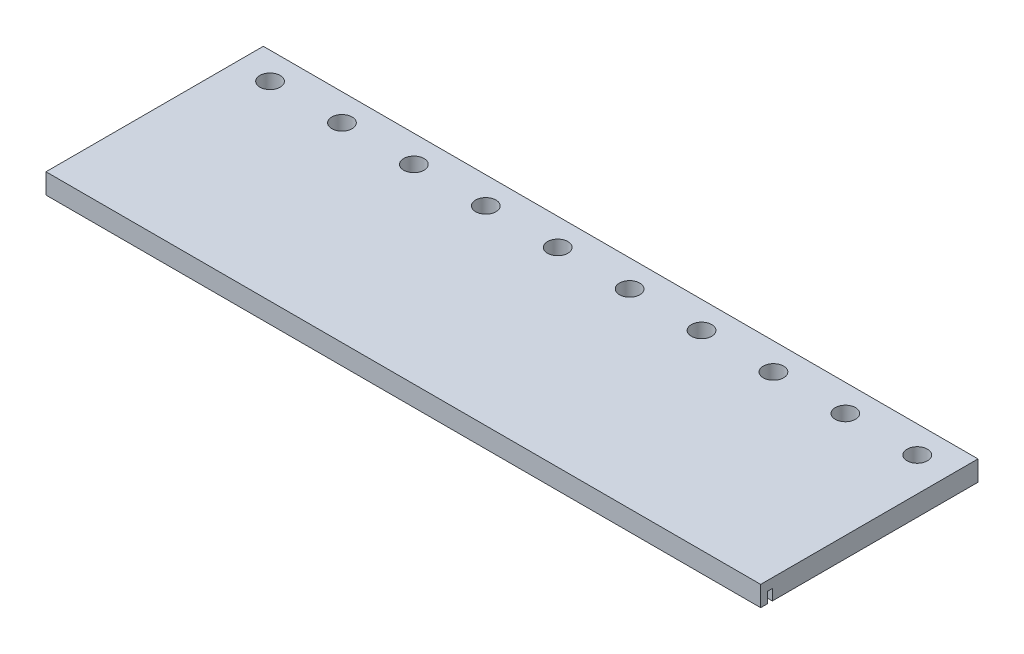
ISO-10303-21;
HEADER;
FILE_DESCRIPTION(('STEP AP214'),'2;1');
FILE_NAME('part.step','',(''),(''),'','','');
FILE_SCHEMA(('AUTOMOTIVE_DESIGN { 1 0 10303 214 1 1 1 1 }'));
ENDSEC;
DATA;
#1=APPLICATION_CONTEXT('core data for automotive mechanical design processes');
#2=APPLICATION_PROTOCOL_DEFINITION('international standard','automotive_design',2000,#1);
#3=PRODUCT_CONTEXT('',#1,'mechanical');
#4=PRODUCT('Part','Part','',(#3));
#5=PRODUCT_RELATED_PRODUCT_CATEGORY('part','',(#4));
#6=PRODUCT_DEFINITION_FORMATION('','',#4);
#7=PRODUCT_DEFINITION_CONTEXT('part definition',#1,'design');
#8=PRODUCT_DEFINITION('design','',#6,#7);
#9=PRODUCT_DEFINITION_SHAPE('','',#8);
#10=(LENGTH_UNIT() NAMED_UNIT(*) SI_UNIT(.MILLI.,.METRE.));
#11=(NAMED_UNIT(*) PLANE_ANGLE_UNIT() SI_UNIT($,.RADIAN.));
#12=(NAMED_UNIT(*) SI_UNIT($,.STERADIAN.) SOLID_ANGLE_UNIT());
#13=UNCERTAINTY_MEASURE_WITH_UNIT(LENGTH_MEASURE(1.E-05),#10,'distance_accuracy_value','');
#14=(GEOMETRIC_REPRESENTATION_CONTEXT(3) GLOBAL_UNCERTAINTY_ASSIGNED_CONTEXT((#13)) GLOBAL_UNIT_ASSIGNED_CONTEXT((#10,
#11,#12)) REPRESENTATION_CONTEXT('',''));
#15=CARTESIAN_POINT('',(0.,0.,0.));
#16=DIRECTION('',(0.,0.,1.));
#17=DIRECTION('',(1.,0.,0.));
#18=AXIS2_PLACEMENT_3D('',#15,#16,#17);
#19=CARTESIAN_POINT('',(0.,-9.525,0.));
#20=DIRECTION('',(0.,-1.,0.));
#21=DIRECTION('',(0.,0.,-1.));
#22=AXIS2_PLACEMENT_3D('',#19,#20,#21);
#23=PLANE('',#22);
#24=CARTESIAN_POINT('',(-323.05625,-9.525,-34.2920964653036));
#25=DIRECTION('',(0.,-1.,0.));
#26=DIRECTION('',(0.,0.,-1.));
#27=AXIS2_PLACEMENT_3D('',#24,#25,#26);
#28=CIRCLE('',#27,8.001);
#29=CARTESIAN_POINT('',(-323.05625,-9.525,-26.2910964653036));
#30=VERTEX_POINT('',#29);
#31=CARTESIAN_POINT('',(-323.05625,-9.525,-42.2930964653036));
#32=VERTEX_POINT('',#31);
#33=EDGE_CURVE('E47',#30,#32,#28,.T.);
#34=ORIENTED_EDGE('',*,*,#33,.F.);
#35=DIRECTION('',(-1.,0.,0.));
#36=VECTOR('',#35,1.);
#37=CARTESIAN_POINT('',(-323.05625,-9.525,-26.2910964653036));
#38=LINE('',#37,#36);
#39=CARTESIAN_POINT('',(323.05625,-9.525,-26.2910964653035));
#40=VERTEX_POINT('',#39);
#41=EDGE_CURVE('E141',#40,#30,#38,.T.);
#42=ORIENTED_EDGE('',*,*,#41,.F.);
#43=CARTESIAN_POINT('',(323.05625,-9.525,-34.2920964653035));
#44=DIRECTION('',(0.,-1.,0.));
#45=DIRECTION('',(0.,0.,-1.));
#46=AXIS2_PLACEMENT_3D('',#43,#44,#45);
#47=CIRCLE('',#46,8.001);
#48=CARTESIAN_POINT('',(323.05625,-9.525,-42.2930964653035));
#49=VERTEX_POINT('',#48);
#50=EDGE_CURVE('E144',#49,#40,#47,.T.);
#51=ORIENTED_EDGE('',*,*,#50,.F.);
#52=DIRECTION('',(1.,0.,0.));
#53=VECTOR('',#52,1.);
#54=CARTESIAN_POINT('',(-323.05625,-9.525,-42.2930964653036));
#55=LINE('',#54,#53);
#56=EDGE_CURVE('E150',#32,#49,#55,.T.);
#57=ORIENTED_EDGE('',*,*,#56,.F.);
#58=EDGE_LOOP('',(#34,#42,#51,#57));
#59=FACE_BOUND('',#58,.T.);
#60=DIRECTION('',(1.,0.,0.));
#61=VECTOR('',#60,1.);
#62=CARTESIAN_POINT('',(336.55,-9.525,91.3365458000001));
#63=LINE('',#62,#61);
#64=CARTESIAN_POINT('',(-336.55,-9.525,91.3365458));
#65=VERTEX_POINT('',#64);
#66=CARTESIAN_POINT('',(336.55,-9.525,91.3365458000001));
#67=VERTEX_POINT('',#66);
#68=EDGE_CURVE('E164',#65,#67,#63,.T.);
#69=ORIENTED_EDGE('',*,*,#68,.F.);
#70=DIRECTION('',(0.,0.,1.));
#71=VECTOR('',#70,1.);
#72=CARTESIAN_POINT('',(-336.55,-9.525,-102.3366));
#73=LINE('',#72,#71);
#74=CARTESIAN_POINT('',(-336.55,-9.525,-102.3366));
#75=VERTEX_POINT('',#74);
#76=EDGE_CURVE('E255',#75,#65,#73,.T.);
#77=ORIENTED_EDGE('',*,*,#76,.F.);
#78=DIRECTION('',(-1.,0.,0.));
#79=VECTOR('',#78,1.);
#80=CARTESIAN_POINT('',(336.55,-9.525,-102.3366));
#81=LINE('',#80,#79);
#82=CARTESIAN_POINT('',(336.55,-9.525,-102.3366));
#83=VERTEX_POINT('',#82);
#84=EDGE_CURVE('E248',#83,#75,#81,.T.);
#85=ORIENTED_EDGE('',*,*,#84,.F.);
#86=DIRECTION('',(0.,0.,-1.));
#87=VECTOR('',#86,1.);
#88=CARTESIAN_POINT('',(336.55,-9.525,-102.3366));
#89=LINE('',#88,#87);
#90=EDGE_CURVE('E260',#67,#83,#89,.T.);
#91=ORIENTED_EDGE('',*,*,#90,.F.);
#92=EDGE_LOOP('',(#69,#77,#85,#91));
#93=FACE_BOUND('',#92,.T.);
#94=CARTESIAN_POINT('',(-304.8,-9.525,-76.9303710175037));
#95=DIRECTION('',(0.,1.,0.));
#96=DIRECTION('',(0.,0.,1.));
#97=AXIS2_PLACEMENT_3D('',#94,#95,#96);
#98=CIRCLE('',#97,9.58458710352719);
#99=CARTESIAN_POINT('',(-304.8,-9.525,-67.3457839139765));
#100=VERTEX_POINT('',#99);
#101=EDGE_CURVE('E184',#100,#100,#98,.T.);
#102=ORIENTED_EDGE('',*,*,#101,.T.);
#103=EDGE_LOOP('',(#102));
#104=FACE_BOUND('',#103,.T.);
#105=CARTESIAN_POINT('',(-237.0709,-9.525,-76.9303710175037));
#106=DIRECTION('',(0.,1.,0.));
#107=DIRECTION('',(0.,0.,1.));
#108=AXIS2_PLACEMENT_3D('',#105,#106,#107);
#109=CIRCLE('',#108,9.58458710352719);
#110=CARTESIAN_POINT('',(-237.0709,-9.525,-67.3457839139765));
#111=VERTEX_POINT('',#110);
#112=EDGE_CURVE('E188',#111,#111,#109,.T.);
#113=ORIENTED_EDGE('',*,*,#112,.T.);
#114=EDGE_LOOP('',(#113));
#115=FACE_BOUND('',#114,.T.);
#116=CARTESIAN_POINT('',(-169.3418,-9.525,-76.9303710175037));
#117=DIRECTION('',(0.,1.,0.));
#118=DIRECTION('',(0.,0.,1.));
#119=AXIS2_PLACEMENT_3D('',#116,#117,#118);
#120=CIRCLE('',#119,9.58458710352719);
#121=CARTESIAN_POINT('',(-169.3418,-9.525,-67.3457839139765));
#122=VERTEX_POINT('',#121);
#123=EDGE_CURVE('E191',#122,#122,#120,.T.);
#124=ORIENTED_EDGE('',*,*,#123,.T.);
#125=EDGE_LOOP('',(#124));
#126=FACE_BOUND('',#125,.T.);
#127=CARTESIAN_POINT('',(-101.6127,-9.525,-76.9303710175037));
#128=DIRECTION('',(0.,1.,0.));
#129=DIRECTION('',(0.,0.,1.));
#130=AXIS2_PLACEMENT_3D('',#127,#128,#129);
#131=CIRCLE('',#130,9.58458710352719);
#132=CARTESIAN_POINT('',(-101.6127,-9.525,-67.3457839139765));
#133=VERTEX_POINT('',#132);
#134=EDGE_CURVE('E194',#133,#133,#131,.T.);
#135=ORIENTED_EDGE('',*,*,#134,.T.);
#136=EDGE_LOOP('',(#135));
#137=FACE_BOUND('',#136,.T.);
#138=CARTESIAN_POINT('',(-33.8836000000001,-9.525,-76.9303710175037));
#139=DIRECTION('',(0.,1.,0.));
#140=DIRECTION('',(0.,0.,1.));
#141=AXIS2_PLACEMENT_3D('',#138,#139,#140);
#142=CIRCLE('',#141,9.58458710352719);
#143=CARTESIAN_POINT('',(-33.8836000000001,-9.525,-67.3457839139765));
#144=VERTEX_POINT('',#143);
#145=EDGE_CURVE('E197',#144,#144,#142,.T.);
#146=ORIENTED_EDGE('',*,*,#145,.T.);
#147=EDGE_LOOP('',(#146));
#148=FACE_BOUND('',#147,.T.);
#149=CARTESIAN_POINT('',(33.8454999999999,-9.525,-76.9303710175037));
#150=DIRECTION('',(0.,1.,0.));
#151=DIRECTION('',(0.,0.,1.));
#152=AXIS2_PLACEMENT_3D('',#149,#150,#151);
#153=CIRCLE('',#152,9.58458710352719);
#154=CARTESIAN_POINT('',(33.8454999999999,-9.525,-67.3457839139765));
#155=VERTEX_POINT('',#154);
#156=EDGE_CURVE('E200',#155,#155,#153,.T.);
#157=ORIENTED_EDGE('',*,*,#156,.T.);
#158=EDGE_LOOP('',(#157));
#159=FACE_BOUND('',#158,.T.);
#160=CARTESIAN_POINT('',(101.5746,-9.525,-76.9303710175037));
#161=DIRECTION('',(0.,1.,0.));
#162=DIRECTION('',(0.,0.,1.));
#163=AXIS2_PLACEMENT_3D('',#160,#161,#162);
#164=CIRCLE('',#163,9.58458710352719);
#165=CARTESIAN_POINT('',(101.5746,-9.525,-67.3457839139765));
#166=VERTEX_POINT('',#165);
#167=EDGE_CURVE('E203',#166,#166,#164,.T.);
#168=ORIENTED_EDGE('',*,*,#167,.T.);
#169=EDGE_LOOP('',(#168));
#170=FACE_BOUND('',#169,.T.);
#171=CARTESIAN_POINT('',(169.3037,-9.525,-76.9303710175037));
#172=DIRECTION('',(0.,1.,0.));
#173=DIRECTION('',(0.,0.,1.));
#174=AXIS2_PLACEMENT_3D('',#171,#172,#173);
#175=CIRCLE('',#174,9.58458710352719);
#176=CARTESIAN_POINT('',(169.3037,-9.525,-67.3457839139765));
#177=VERTEX_POINT('',#176);
#178=EDGE_CURVE('E206',#177,#177,#175,.T.);
#179=ORIENTED_EDGE('',*,*,#178,.T.);
#180=EDGE_LOOP('',(#179));
#181=FACE_BOUND('',#180,.T.);
#182=CARTESIAN_POINT('',(237.0328,-9.525,-76.9303710175037));
#183=DIRECTION('',(0.,1.,0.));
#184=DIRECTION('',(0.,0.,1.));
#185=AXIS2_PLACEMENT_3D('',#182,#183,#184);
#186=CIRCLE('',#185,9.58458710352719);
#187=CARTESIAN_POINT('',(237.0328,-9.525,-67.3457839139765));
#188=VERTEX_POINT('',#187);
#189=EDGE_CURVE('E209',#188,#188,#186,.T.);
#190=ORIENTED_EDGE('',*,*,#189,.T.);
#191=EDGE_LOOP('',(#190));
#192=FACE_BOUND('',#191,.T.);
#193=CARTESIAN_POINT('',(304.7619,-9.525,-76.9303710175037));
#194=DIRECTION('',(0.,1.,0.));
#195=DIRECTION('',(0.,0.,1.));
#196=AXIS2_PLACEMENT_3D('',#193,#194,#195);
#197=CIRCLE('',#196,9.58458710352719);
#198=CARTESIAN_POINT('',(304.7619,-9.525,-67.3457839139765));
#199=VERTEX_POINT('',#198);
#200=EDGE_CURVE('E177',#199,#199,#197,.T.);
#201=ORIENTED_EDGE('',*,*,#200,.T.);
#202=EDGE_LOOP('',(#201));
#203=FACE_BOUND('',#202,.T.);
#204=ADVANCED_FACE('F32',(#59,#93,#104,#115,#126,#137,#148,#159,#170,#181,#192,#203),#23,.T.);
#205=CARTESIAN_POINT('',(-336.55,9.525,-102.3366));
#206=DIRECTION('',(1.,0.,0.));
#207=DIRECTION('',(0.,0.,-1.));
#208=AXIS2_PLACEMENT_3D('',#205,#206,#207);
#209=PLANE('',#208);
#210=ORIENTED_EDGE('',*,*,#76,.T.);
#211=DIRECTION('',(0.,-1.,0.));
#212=VECTOR('',#211,1.);
#213=CARTESIAN_POINT('',(-336.55,0.635,91.3365458));
#214=LINE('',#213,#212);
#215=CARTESIAN_POINT('',(-336.55,0.635,91.3365458));
#216=VERTEX_POINT('',#215);
#217=EDGE_CURVE('E178',#216,#65,#214,.T.);
#218=ORIENTED_EDGE('',*,*,#217,.F.);
#219=DIRECTION('',(0.,0.,-1.));
#220=VECTOR('',#219,1.);
#221=CARTESIAN_POINT('',(-336.55,0.635,96.0355458));
#222=LINE('',#221,#220);
#223=CARTESIAN_POINT('',(-336.55,0.635,96.0355458));
#224=VERTEX_POINT('',#223);
#225=EDGE_CURVE('E167',#224,#216,#222,.T.);
#226=ORIENTED_EDGE('',*,*,#225,.F.);
#227=DIRECTION('',(0.,-1.,0.));
#228=VECTOR('',#227,1.);
#229=CARTESIAN_POINT('',(-336.55,0.635,96.0355458));
#230=LINE('',#229,#228);
#231=CARTESIAN_POINT('',(-336.55,-9.525,96.0355458));
#232=VERTEX_POINT('',#231);
#233=EDGE_CURVE('E180',#224,#232,#230,.T.);
#234=ORIENTED_EDGE('',*,*,#233,.T.);
#235=CARTESIAN_POINT('',(-336.55,-9.525,102.3366));
#236=VERTEX_POINT('',#235);
#237=EDGE_CURVE('E243',#232,#236,#73,.T.);
#238=ORIENTED_EDGE('',*,*,#237,.T.);
#239=DIRECTION('',(0.,-1.,0.));
#240=VECTOR('',#239,1.);
#241=CARTESIAN_POINT('',(-336.55,9.525,102.3366));
#242=LINE('',#241,#240);
#243=CARTESIAN_POINT('',(-336.55,9.525,102.3366));
#244=VERTEX_POINT('',#243);
#245=EDGE_CURVE('E11',#244,#236,#242,.T.);
#246=ORIENTED_EDGE('',*,*,#245,.F.);
#247=DIRECTION('',(0.,0.,1.));
#248=VECTOR('',#247,1.);
#249=CARTESIAN_POINT('',(-336.55,9.525,-102.3366));
#250=LINE('',#249,#248);
#251=CARTESIAN_POINT('',(-336.55,9.525,-102.3366));
#252=VERTEX_POINT('',#251);
#253=EDGE_CURVE('E244',#252,#244,#250,.T.);
#254=ORIENTED_EDGE('',*,*,#253,.F.);
#255=DIRECTION('',(0.,-1.,0.));
#256=VECTOR('',#255,1.);
#257=CARTESIAN_POINT('',(-336.55,9.525,-102.3366));
#258=LINE('',#257,#256);
#259=EDGE_CURVE('E254',#252,#75,#258,.T.);
#260=ORIENTED_EDGE('',*,*,#259,.T.);
#261=EDGE_LOOP('',(#210,#218,#226,#234,#238,#246,#254,#260));
#262=FACE_BOUND('',#261,.T.);
#263=ADVANCED_FACE('F34',(#262),#209,.F.);
#264=CARTESIAN_POINT('',(336.55,9.525,102.3366));
#265=DIRECTION('',(0.,0.,-1.));
#266=DIRECTION('',(-1.,0.,0.));
#267=AXIS2_PLACEMENT_3D('',#264,#265,#266);
#268=PLANE('',#267);
#269=DIRECTION('',(1.,0.,0.));
#270=VECTOR('',#269,1.);
#271=CARTESIAN_POINT('',(336.55,-9.525,102.3366));
#272=LINE('',#271,#270);
#273=CARTESIAN_POINT('',(336.55,-9.525,102.3366));
#274=VERTEX_POINT('',#273);
#275=EDGE_CURVE('E258',#236,#274,#272,.T.);
#276=ORIENTED_EDGE('',*,*,#275,.T.);
#277=DIRECTION('',(0.,-1.,0.));
#278=VECTOR('',#277,1.);
#279=CARTESIAN_POINT('',(336.55,9.525,102.3366));
#280=LINE('',#279,#278);
#281=CARTESIAN_POINT('',(336.55,9.525,102.3366));
#282=VERTEX_POINT('',#281);
#283=EDGE_CURVE('E40',#282,#274,#280,.T.);
#284=ORIENTED_EDGE('',*,*,#283,.F.);
#285=DIRECTION('',(1.,0.,0.));
#286=VECTOR('',#285,1.);
#287=CARTESIAN_POINT('',(336.55,9.525,102.3366));
#288=LINE('',#287,#286);
#289=EDGE_CURVE('E247',#244,#282,#288,.T.);
#290=ORIENTED_EDGE('',*,*,#289,.F.);
#291=ORIENTED_EDGE('',*,*,#245,.T.);
#292=EDGE_LOOP('',(#276,#284,#290,#291));
#293=FACE_BOUND('',#292,.T.);
#294=ADVANCED_FACE('F305',(#293),#268,.F.);
#295=CARTESIAN_POINT('',(336.55,9.525,-102.3366));
#296=DIRECTION('',(-1.,0.,0.));
#297=DIRECTION('',(0.,0.,1.));
#298=AXIS2_PLACEMENT_3D('',#295,#296,#297);
#299=PLANE('',#298);
#300=DIRECTION('',(0.,0.,1.));
#301=VECTOR('',#300,1.);
#302=CARTESIAN_POINT('',(336.55,0.635,96.0355458000001));
#303=LINE('',#302,#301);
#304=CARTESIAN_POINT('',(336.55,0.635,91.3365458000001));
#305=VERTEX_POINT('',#304);
#306=CARTESIAN_POINT('',(336.55,0.635,96.0355458000001));
#307=VERTEX_POINT('',#306);
#308=EDGE_CURVE('E160',#305,#307,#303,.T.);
#309=ORIENTED_EDGE('',*,*,#308,.F.);
#310=DIRECTION('',(0.,-1.,0.));
#311=VECTOR('',#310,1.);
#312=CARTESIAN_POINT('',(336.55,0.635,91.3365458000001));
#313=LINE('',#312,#311);
#314=EDGE_CURVE('E174',#305,#67,#313,.T.);
#315=ORIENTED_EDGE('',*,*,#314,.T.);
#316=ORIENTED_EDGE('',*,*,#90,.T.);
#317=DIRECTION('',(0.,-1.,0.));
#318=VECTOR('',#317,1.);
#319=CARTESIAN_POINT('',(336.55,9.525,-102.3366));
#320=LINE('',#319,#318);
#321=CARTESIAN_POINT('',(336.55,9.525,-102.3366));
#322=VERTEX_POINT('',#321);
#323=EDGE_CURVE('E267',#322,#83,#320,.T.);
#324=ORIENTED_EDGE('',*,*,#323,.F.);
#325=DIRECTION('',(0.,0.,-1.));
#326=VECTOR('',#325,1.);
#327=CARTESIAN_POINT('',(336.55,9.525,-102.3366));
#328=LINE('',#327,#326);
#329=EDGE_CURVE('E250',#282,#322,#328,.T.);
#330=ORIENTED_EDGE('',*,*,#329,.F.);
#331=ORIENTED_EDGE('',*,*,#283,.T.);
#332=CARTESIAN_POINT('',(336.55,-9.525,96.0355458000001));
#333=VERTEX_POINT('',#332);
#334=EDGE_CURVE('E261',#274,#333,#89,.T.);
#335=ORIENTED_EDGE('',*,*,#334,.T.);
#336=DIRECTION('',(0.,-1.,0.));
#337=VECTOR('',#336,1.);
#338=CARTESIAN_POINT('',(336.55,0.635,96.0355458000001));
#339=LINE('',#338,#337);
#340=EDGE_CURVE('E55',#307,#333,#339,.T.);
#341=ORIENTED_EDGE('',*,*,#340,.F.);
#342=EDGE_LOOP('',(#309,#315,#316,#324,#330,#331,#335,#341));
#343=FACE_BOUND('',#342,.T.);
#344=ADVANCED_FACE('F275',(#343),#299,.F.);
#345=CARTESIAN_POINT('',(336.55,9.525,-102.3366));
#346=DIRECTION('',(0.,0.,1.));
#347=DIRECTION('',(1.,0.,0.));
#348=AXIS2_PLACEMENT_3D('',#345,#346,#347);
#349=PLANE('',#348);
#350=ORIENTED_EDGE('',*,*,#84,.T.);
#351=ORIENTED_EDGE('',*,*,#259,.F.);
#352=DIRECTION('',(-1.,0.,0.));
#353=VECTOR('',#352,1.);
#354=CARTESIAN_POINT('',(336.55,9.525,-102.3366));
#355=LINE('',#354,#353);
#356=EDGE_CURVE('E252',#322,#252,#355,.T.);
#357=ORIENTED_EDGE('',*,*,#356,.F.);
#358=ORIENTED_EDGE('',*,*,#323,.T.);
#359=EDGE_LOOP('',(#350,#351,#357,#358));
#360=FACE_BOUND('',#359,.T.);
#361=ADVANCED_FACE('F300',(#360),#349,.F.);
#362=CARTESIAN_POINT('',(0.,9.525,0.));
#363=DIRECTION('',(0.,-1.,0.));
#364=DIRECTION('',(0.,0.,-1.));
#365=AXIS2_PLACEMENT_3D('',#362,#363,#364);
#366=PLANE('',#365);
#367=CARTESIAN_POINT('',(-304.8,9.525,-76.9303710175037));
#368=DIRECTION('',(0.,-1.,0.));
#369=DIRECTION('',(0.,0.,-1.));
#370=AXIS2_PLACEMENT_3D('',#367,#368,#369);
#371=CIRCLE('',#370,9.58458710352719);
#372=CARTESIAN_POINT('',(-304.8,9.525,-86.5149581210309));
#373=VERTEX_POINT('',#372);
#374=EDGE_CURVE('E240',#373,#373,#371,.T.);
#375=ORIENTED_EDGE('',*,*,#374,.T.);
#376=EDGE_LOOP('',(#375));
#377=FACE_BOUND('',#376,.T.);
#378=CARTESIAN_POINT('',(-237.0709,9.525,-76.9303710175037));
#379=DIRECTION('',(0.,-1.,0.));
#380=DIRECTION('',(0.,0.,-1.));
#381=AXIS2_PLACEMENT_3D('',#378,#379,#380);
#382=CIRCLE('',#381,9.58458710352719);
#383=CARTESIAN_POINT('',(-237.0709,9.525,-86.5149581210309));
#384=VERTEX_POINT('',#383);
#385=EDGE_CURVE('E237',#384,#384,#382,.T.);
#386=ORIENTED_EDGE('',*,*,#385,.T.);
#387=EDGE_LOOP('',(#386));
#388=FACE_BOUND('',#387,.T.);
#389=CARTESIAN_POINT('',(-169.3418,9.525,-76.9303710175037));
#390=DIRECTION('',(0.,-1.,0.));
#391=DIRECTION('',(0.,0.,-1.));
#392=AXIS2_PLACEMENT_3D('',#389,#390,#391);
#393=CIRCLE('',#392,9.58458710352719);
#394=CARTESIAN_POINT('',(-169.3418,9.525,-86.5149581210309));
#395=VERTEX_POINT('',#394);
#396=EDGE_CURVE('E234',#395,#395,#393,.T.);
#397=ORIENTED_EDGE('',*,*,#396,.T.);
#398=EDGE_LOOP('',(#397));
#399=FACE_BOUND('',#398,.T.);
#400=CARTESIAN_POINT('',(-101.6127,9.525,-76.9303710175037));
#401=DIRECTION('',(0.,-1.,0.));
#402=DIRECTION('',(0.,0.,-1.));
#403=AXIS2_PLACEMENT_3D('',#400,#401,#402);
#404=CIRCLE('',#403,9.58458710352719);
#405=CARTESIAN_POINT('',(-101.6127,9.525,-86.5149581210309));
#406=VERTEX_POINT('',#405);
#407=EDGE_CURVE('E231',#406,#406,#404,.T.);
#408=ORIENTED_EDGE('',*,*,#407,.T.);
#409=EDGE_LOOP('',(#408));
#410=FACE_BOUND('',#409,.T.);
#411=CARTESIAN_POINT('',(-33.8836000000001,9.525,-76.9303710175037));
#412=DIRECTION('',(0.,-1.,0.));
#413=DIRECTION('',(0.,0.,-1.));
#414=AXIS2_PLACEMENT_3D('',#411,#412,#413);
#415=CIRCLE('',#414,9.58458710352719);
#416=CARTESIAN_POINT('',(-33.8836000000001,9.525,-86.5149581210309));
#417=VERTEX_POINT('',#416);
#418=EDGE_CURVE('E228',#417,#417,#415,.T.);
#419=ORIENTED_EDGE('',*,*,#418,.T.);
#420=EDGE_LOOP('',(#419));
#421=FACE_BOUND('',#420,.T.);
#422=CARTESIAN_POINT('',(33.8454999999999,9.525,-76.9303710175037));
#423=DIRECTION('',(0.,-1.,0.));
#424=DIRECTION('',(0.,0.,-1.));
#425=AXIS2_PLACEMENT_3D('',#422,#423,#424);
#426=CIRCLE('',#425,9.58458710352719);
#427=CARTESIAN_POINT('',(33.8454999999999,9.525,-86.5149581210309));
#428=VERTEX_POINT('',#427);
#429=EDGE_CURVE('E225',#428,#428,#426,.T.);
#430=ORIENTED_EDGE('',*,*,#429,.T.);
#431=EDGE_LOOP('',(#430));
#432=FACE_BOUND('',#431,.T.);
#433=CARTESIAN_POINT('',(101.5746,9.525,-76.9303710175037));
#434=DIRECTION('',(0.,-1.,0.));
#435=DIRECTION('',(0.,0.,-1.));
#436=AXIS2_PLACEMENT_3D('',#433,#434,#435);
#437=CIRCLE('',#436,9.58458710352719);
#438=CARTESIAN_POINT('',(101.5746,9.525,-86.5149581210309));
#439=VERTEX_POINT('',#438);
#440=EDGE_CURVE('E222',#439,#439,#437,.T.);
#441=ORIENTED_EDGE('',*,*,#440,.T.);
#442=EDGE_LOOP('',(#441));
#443=FACE_BOUND('',#442,.T.);
#444=CARTESIAN_POINT('',(169.3037,9.525,-76.9303710175037));
#445=DIRECTION('',(0.,-1.,0.));
#446=DIRECTION('',(0.,0.,-1.));
#447=AXIS2_PLACEMENT_3D('',#444,#445,#446);
#448=CIRCLE('',#447,9.58458710352719);
#449=CARTESIAN_POINT('',(169.3037,9.525,-86.5149581210309));
#450=VERTEX_POINT('',#449);
#451=EDGE_CURVE('E219',#450,#450,#448,.T.);
#452=ORIENTED_EDGE('',*,*,#451,.T.);
#453=EDGE_LOOP('',(#452));
#454=FACE_BOUND('',#453,.T.);
#455=CARTESIAN_POINT('',(237.0328,9.525,-76.9303710175037));
#456=DIRECTION('',(0.,-1.,0.));
#457=DIRECTION('',(0.,0.,-1.));
#458=AXIS2_PLACEMENT_3D('',#455,#456,#457);
#459=CIRCLE('',#458,9.58458710352719);
#460=CARTESIAN_POINT('',(237.0328,9.525,-86.5149581210309));
#461=VERTEX_POINT('',#460);
#462=EDGE_CURVE('E216',#461,#461,#459,.T.);
#463=ORIENTED_EDGE('',*,*,#462,.T.);
#464=EDGE_LOOP('',(#463));
#465=FACE_BOUND('',#464,.T.);
#466=CARTESIAN_POINT('',(304.7619,9.525,-76.9303710175037));
#467=DIRECTION('',(0.,-1.,0.));
#468=DIRECTION('',(0.,0.,-1.));
#469=AXIS2_PLACEMENT_3D('',#466,#467,#468);
#470=CIRCLE('',#469,9.58458710352719);
#471=CARTESIAN_POINT('',(304.7619,9.525,-86.5149581210309));
#472=VERTEX_POINT('',#471);
#473=EDGE_CURVE('E187',#472,#472,#470,.T.);
#474=ORIENTED_EDGE('',*,*,#473,.T.);
#475=EDGE_LOOP('',(#474));
#476=FACE_BOUND('',#475,.T.);
#477=ORIENTED_EDGE('',*,*,#253,.T.);
#478=ORIENTED_EDGE('',*,*,#289,.T.);
#479=ORIENTED_EDGE('',*,*,#329,.T.);
#480=ORIENTED_EDGE('',*,*,#356,.T.);
#481=EDGE_LOOP('',(#477,#478,#479,#480));
#482=FACE_BOUND('',#481,.T.);
#483=ADVANCED_FACE('F304',(#377,#388,#399,#410,#421,#432,#443,#454,#465,#476,#482),#366,.F.);
#484=DIRECTION('',(-1.,0.,0.));
#485=VECTOR('',#484,1.);
#486=CARTESIAN_POINT('',(336.55,-9.525,96.0355458000001));
#487=LINE('',#486,#485);
#488=EDGE_CURVE('E156',#333,#232,#487,.T.);
#489=ORIENTED_EDGE('',*,*,#488,.F.);
#490=ORIENTED_EDGE('',*,*,#334,.F.);
#491=ORIENTED_EDGE('',*,*,#275,.F.);
#492=ORIENTED_EDGE('',*,*,#237,.F.);
#493=EDGE_LOOP('',(#489,#490,#491,#492));
#494=FACE_BOUND('',#493,.T.);
#495=ADVANCED_FACE('F280',(#494),#23,.T.);
#496=CARTESIAN_POINT('',(304.7619,-9.525,-76.9303710175037));
#497=DIRECTION('',(0.,1.,0.));
#498=DIRECTION('',(0.,0.,1.));
#499=AXIS2_PLACEMENT_3D('',#496,#497,#498);
#500=CYLINDRICAL_SURFACE('',#499,9.58458710352719);
#501=ORIENTED_EDGE('',*,*,#200,.F.);
#502=EDGE_LOOP('',(#501));
#503=FACE_BOUND('',#502,.T.);
#504=ORIENTED_EDGE('',*,*,#473,.F.);
#505=EDGE_LOOP('',(#504));
#506=FACE_BOUND('',#505,.T.);
#507=ADVANCED_FACE('F320',(#503,#506),#500,.F.);
#508=CARTESIAN_POINT('',(237.0328,-9.525,-76.9303710175037));
#509=DIRECTION('',(0.,1.,0.));
#510=DIRECTION('',(0.,0.,1.));
#511=AXIS2_PLACEMENT_3D('',#508,#509,#510);
#512=CYLINDRICAL_SURFACE('',#511,9.58458710352719);
#513=ORIENTED_EDGE('',*,*,#189,.F.);
#514=EDGE_LOOP('',(#513));
#515=FACE_BOUND('',#514,.T.);
#516=ORIENTED_EDGE('',*,*,#462,.F.);
#517=EDGE_LOOP('',(#516));
#518=FACE_BOUND('',#517,.T.);
#519=ADVANCED_FACE('F325',(#515,#518),#512,.F.);
#520=CARTESIAN_POINT('',(169.3037,-9.525,-76.9303710175037));
#521=DIRECTION('',(0.,1.,0.));
#522=DIRECTION('',(0.,0.,1.));
#523=AXIS2_PLACEMENT_3D('',#520,#521,#522);
#524=CYLINDRICAL_SURFACE('',#523,9.58458710352719);
#525=ORIENTED_EDGE('',*,*,#178,.F.);
#526=EDGE_LOOP('',(#525));
#527=FACE_BOUND('',#526,.T.);
#528=ORIENTED_EDGE('',*,*,#451,.F.);
#529=EDGE_LOOP('',(#528));
#530=FACE_BOUND('',#529,.T.);
#531=ADVANCED_FACE('F336',(#527,#530),#524,.F.);
#532=CARTESIAN_POINT('',(101.5746,-9.525,-76.9303710175037));
#533=DIRECTION('',(0.,1.,0.));
#534=DIRECTION('',(0.,0.,1.));
#535=AXIS2_PLACEMENT_3D('',#532,#533,#534);
#536=CYLINDRICAL_SURFACE('',#535,9.58458710352719);
#537=ORIENTED_EDGE('',*,*,#167,.F.);
#538=EDGE_LOOP('',(#537));
#539=FACE_BOUND('',#538,.T.);
#540=ORIENTED_EDGE('',*,*,#440,.F.);
#541=EDGE_LOOP('',(#540));
#542=FACE_BOUND('',#541,.T.);
#543=ADVANCED_FACE('F340',(#539,#542),#536,.F.);
#544=CARTESIAN_POINT('',(33.8454999999999,-9.525,-76.9303710175037));
#545=DIRECTION('',(0.,1.,0.));
#546=DIRECTION('',(0.,0.,1.));
#547=AXIS2_PLACEMENT_3D('',#544,#545,#546);
#548=CYLINDRICAL_SURFACE('',#547,9.58458710352719);
#549=ORIENTED_EDGE('',*,*,#156,.F.);
#550=EDGE_LOOP('',(#549));
#551=FACE_BOUND('',#550,.T.);
#552=ORIENTED_EDGE('',*,*,#429,.F.);
#553=EDGE_LOOP('',(#552));
#554=FACE_BOUND('',#553,.T.);
#555=ADVANCED_FACE('F344',(#551,#554),#548,.F.);
#556=CARTESIAN_POINT('',(-33.8836000000001,-9.525,-76.9303710175037));
#557=DIRECTION('',(0.,1.,0.));
#558=DIRECTION('',(0.,0.,1.));
#559=AXIS2_PLACEMENT_3D('',#556,#557,#558);
#560=CYLINDRICAL_SURFACE('',#559,9.58458710352719);
#561=ORIENTED_EDGE('',*,*,#145,.F.);
#562=EDGE_LOOP('',(#561));
#563=FACE_BOUND('',#562,.T.);
#564=ORIENTED_EDGE('',*,*,#418,.F.);
#565=EDGE_LOOP('',(#564));
#566=FACE_BOUND('',#565,.T.);
#567=ADVANCED_FACE('F348',(#563,#566),#560,.F.);
#568=CARTESIAN_POINT('',(-101.6127,-9.525,-76.9303710175037));
#569=DIRECTION('',(0.,1.,0.));
#570=DIRECTION('',(0.,0.,1.));
#571=AXIS2_PLACEMENT_3D('',#568,#569,#570);
#572=CYLINDRICAL_SURFACE('',#571,9.58458710352719);
#573=ORIENTED_EDGE('',*,*,#134,.F.);
#574=EDGE_LOOP('',(#573));
#575=FACE_BOUND('',#574,.T.);
#576=ORIENTED_EDGE('',*,*,#407,.F.);
#577=EDGE_LOOP('',(#576));
#578=FACE_BOUND('',#577,.T.);
#579=ADVANCED_FACE('F352',(#575,#578),#572,.F.);
#580=CARTESIAN_POINT('',(-169.3418,-9.525,-76.9303710175037));
#581=DIRECTION('',(0.,1.,0.));
#582=DIRECTION('',(0.,0.,1.));
#583=AXIS2_PLACEMENT_3D('',#580,#581,#582);
#584=CYLINDRICAL_SURFACE('',#583,9.58458710352719);
#585=ORIENTED_EDGE('',*,*,#123,.F.);
#586=EDGE_LOOP('',(#585));
#587=FACE_BOUND('',#586,.T.);
#588=ORIENTED_EDGE('',*,*,#396,.F.);
#589=EDGE_LOOP('',(#588));
#590=FACE_BOUND('',#589,.T.);
#591=ADVANCED_FACE('F356',(#587,#590),#584,.F.);
#592=CARTESIAN_POINT('',(-237.0709,-9.525,-76.9303710175037));
#593=DIRECTION('',(0.,1.,0.));
#594=DIRECTION('',(0.,0.,1.));
#595=AXIS2_PLACEMENT_3D('',#592,#593,#594);
#596=CYLINDRICAL_SURFACE('',#595,9.58458710352719);
#597=ORIENTED_EDGE('',*,*,#112,.F.);
#598=EDGE_LOOP('',(#597));
#599=FACE_BOUND('',#598,.T.);
#600=ORIENTED_EDGE('',*,*,#385,.F.);
#601=EDGE_LOOP('',(#600));
#602=FACE_BOUND('',#601,.T.);
#603=ADVANCED_FACE('F360',(#599,#602),#596,.F.);
#604=CARTESIAN_POINT('',(-304.8,-9.525,-76.9303710175037));
#605=DIRECTION('',(0.,1.,0.));
#606=DIRECTION('',(0.,0.,1.));
#607=AXIS2_PLACEMENT_3D('',#604,#605,#606);
#608=CYLINDRICAL_SURFACE('',#607,9.58458710352719);
#609=ORIENTED_EDGE('',*,*,#101,.F.);
#610=EDGE_LOOP('',(#609));
#611=FACE_BOUND('',#610,.T.);
#612=ORIENTED_EDGE('',*,*,#374,.F.);
#613=EDGE_LOOP('',(#612));
#614=FACE_BOUND('',#613,.T.);
#615=ADVANCED_FACE('F364',(#611,#614),#608,.F.);
#616=CARTESIAN_POINT('',(336.55,0.635,91.3365458000001));
#617=DIRECTION('',(0.,0.,-1.));
#618=DIRECTION('',(-1.,0.,0.));
#619=AXIS2_PLACEMENT_3D('',#616,#617,#618);
#620=PLANE('',#619);
#621=ORIENTED_EDGE('',*,*,#68,.T.);
#622=ORIENTED_EDGE('',*,*,#314,.F.);
#623=DIRECTION('',(1.,0.,0.));
#624=VECTOR('',#623,1.);
#625=CARTESIAN_POINT('',(336.55,0.635,91.3365458000001));
#626=LINE('',#625,#624);
#627=EDGE_CURVE('E169',#216,#305,#626,.T.);
#628=ORIENTED_EDGE('',*,*,#627,.F.);
#629=ORIENTED_EDGE('',*,*,#217,.T.);
#630=EDGE_LOOP('',(#621,#622,#628,#629));
#631=FACE_BOUND('',#630,.T.);
#632=ADVANCED_FACE('F291',(#631),#620,.F.);
#633=CARTESIAN_POINT('',(336.55,0.635,96.0355458000001));
#634=DIRECTION('',(0.,0.,1.));
#635=DIRECTION('',(1.,0.,0.));
#636=AXIS2_PLACEMENT_3D('',#633,#634,#635);
#637=PLANE('',#636);
#638=ORIENTED_EDGE('',*,*,#488,.T.);
#639=ORIENTED_EDGE('',*,*,#233,.F.);
#640=DIRECTION('',(-1.,0.,0.));
#641=VECTOR('',#640,1.);
#642=CARTESIAN_POINT('',(336.55,0.635,96.0355458000001));
#643=LINE('',#642,#641);
#644=EDGE_CURVE('E163',#307,#224,#643,.T.);
#645=ORIENTED_EDGE('',*,*,#644,.F.);
#646=ORIENTED_EDGE('',*,*,#340,.T.);
#647=EDGE_LOOP('',(#638,#639,#645,#646));
#648=FACE_BOUND('',#647,.T.);
#649=ADVANCED_FACE('F282',(#648),#637,.F.);
#650=CARTESIAN_POINT('',(0.,0.635,0.));
#651=DIRECTION('',(0.,1.,0.));
#652=DIRECTION('',(0.,0.,1.));
#653=AXIS2_PLACEMENT_3D('',#650,#651,#652);
#654=PLANE('',#653);
#655=ORIENTED_EDGE('',*,*,#308,.T.);
#656=ORIENTED_EDGE('',*,*,#644,.T.);
#657=ORIENTED_EDGE('',*,*,#225,.T.);
#658=ORIENTED_EDGE('',*,*,#627,.T.);
#659=EDGE_LOOP('',(#655,#656,#657,#658));
#660=FACE_BOUND('',#659,.T.);
#661=ADVANCED_FACE('F289',(#660),#654,.F.);
#662=CARTESIAN_POINT('',(-323.05625,-1.5875,-34.2920964653036));
#663=DIRECTION('',(0.,-1.,0.));
#664=DIRECTION('',(0.,0.,-1.));
#665=AXIS2_PLACEMENT_3D('',#662,#663,#664);
#666=CYLINDRICAL_SURFACE('',#665,8.001);
#667=ORIENTED_EDGE('',*,*,#33,.T.);
#668=DIRECTION('',(0.,-1.,0.));
#669=VECTOR('',#668,1.);
#670=CARTESIAN_POINT('',(-323.05625,-1.5875,-42.2930964653036));
#671=LINE('',#670,#669);
#672=CARTESIAN_POINT('',(-323.05625,-1.5875,-42.2930964653036));
#673=VERTEX_POINT('',#672);
#674=EDGE_CURVE('E119',#673,#32,#671,.T.);
#675=ORIENTED_EDGE('',*,*,#674,.F.);
#676=CARTESIAN_POINT('',(-323.05625,-1.5875,-34.2920964653036));
#677=DIRECTION('',(0.,-1.,0.));
#678=DIRECTION('',(0.,0.,-1.));
#679=AXIS2_PLACEMENT_3D('',#676,#677,#678);
#680=CIRCLE('',#679,8.001);
#681=CARTESIAN_POINT('',(-323.05625,-1.5875,-26.2910964653036));
#682=VERTEX_POINT('',#681);
#683=EDGE_CURVE('E123',#682,#673,#680,.T.);
#684=ORIENTED_EDGE('',*,*,#683,.F.);
#685=DIRECTION('',(0.,-1.,0.));
#686=VECTOR('',#685,1.);
#687=CARTESIAN_POINT('',(-323.05625,-1.5875,-26.2910964653036));
#688=LINE('',#687,#686);
#689=EDGE_CURVE('E154',#682,#30,#688,.T.);
#690=ORIENTED_EDGE('',*,*,#689,.T.);
#691=EDGE_LOOP('',(#667,#675,#684,#690));
#692=FACE_BOUND('',#691,.T.);
#693=ADVANCED_FACE('F121',(#692),#666,.F.);
#694=CARTESIAN_POINT('',(-323.05625,-1.5875,-26.2910964653036));
#695=DIRECTION('',(0.,0.,1.));
#696=DIRECTION('',(1.,0.,0.));
#697=AXIS2_PLACEMENT_3D('',#694,#695,#696);
#698=PLANE('',#697);
#699=ORIENTED_EDGE('',*,*,#41,.T.);
#700=ORIENTED_EDGE('',*,*,#689,.F.);
#701=DIRECTION('',(-1.,0.,0.));
#702=VECTOR('',#701,1.);
#703=CARTESIAN_POINT('',(-323.05625,-1.5875,-26.2910964653036));
#704=LINE('',#703,#702);
#705=CARTESIAN_POINT('',(323.05625,-1.5875,-26.2910964653035));
#706=VERTEX_POINT('',#705);
#707=EDGE_CURVE('E129',#706,#682,#704,.T.);
#708=ORIENTED_EDGE('',*,*,#707,.F.);
#709=DIRECTION('',(0.,-1.,0.));
#710=VECTOR('',#709,1.);
#711=CARTESIAN_POINT('',(323.05625,-1.5875,-26.2910964653035));
#712=LINE('',#711,#710);
#713=EDGE_CURVE('E157',#706,#40,#712,.T.);
#714=ORIENTED_EDGE('',*,*,#713,.T.);
#715=EDGE_LOOP('',(#699,#700,#708,#714));
#716=FACE_BOUND('',#715,.T.);
#717=ADVANCED_FACE('F377',(#716),#698,.F.);
#718=CARTESIAN_POINT('',(323.05625,-1.5875,-34.2920964653035));
#719=DIRECTION('',(0.,-1.,0.));
#720=DIRECTION('',(0.,0.,-1.));
#721=AXIS2_PLACEMENT_3D('',#718,#719,#720);
#722=CYLINDRICAL_SURFACE('',#721,8.001);
#723=ORIENTED_EDGE('',*,*,#50,.T.);
#724=ORIENTED_EDGE('',*,*,#713,.F.);
#725=CARTESIAN_POINT('',(323.05625,-1.5875,-34.2920964653035));
#726=DIRECTION('',(0.,-1.,0.));
#727=DIRECTION('',(0.,0.,-1.));
#728=AXIS2_PLACEMENT_3D('',#725,#726,#727);
#729=CIRCLE('',#728,8.001);
#730=CARTESIAN_POINT('',(323.05625,-1.5875,-42.2930964653035));
#731=VERTEX_POINT('',#730);
#732=EDGE_CURVE('E137',#731,#706,#729,.T.);
#733=ORIENTED_EDGE('',*,*,#732,.F.);
#734=DIRECTION('',(0.,-1.,0.));
#735=VECTOR('',#734,1.);
#736=CARTESIAN_POINT('',(323.05625,-1.5875,-42.2930964653035));
#737=LINE('',#736,#735);
#738=EDGE_CURVE('E128',#731,#49,#737,.T.);
#739=ORIENTED_EDGE('',*,*,#738,.T.);
#740=EDGE_LOOP('',(#723,#724,#733,#739));
#741=FACE_BOUND('',#740,.T.);
#742=ADVANCED_FACE('F380',(#741),#722,.F.);
#743=CARTESIAN_POINT('',(-323.05625,-1.5875,-42.2930964653036));
#744=DIRECTION('',(0.,0.,-1.));
#745=DIRECTION('',(-1.,0.,0.));
#746=AXIS2_PLACEMENT_3D('',#743,#744,#745);
#747=PLANE('',#746);
#748=ORIENTED_EDGE('',*,*,#56,.T.);
#749=ORIENTED_EDGE('',*,*,#738,.F.);
#750=DIRECTION('',(1.,0.,0.));
#751=VECTOR('',#750,1.);
#752=CARTESIAN_POINT('',(-323.05625,-1.5875,-42.2930964653036));
#753=LINE('',#752,#751);
#754=EDGE_CURVE('E132',#673,#731,#753,.T.);
#755=ORIENTED_EDGE('',*,*,#754,.F.);
#756=ORIENTED_EDGE('',*,*,#674,.T.);
#757=EDGE_LOOP('',(#748,#749,#755,#756));
#758=FACE_BOUND('',#757,.T.);
#759=ADVANCED_FACE('F133',(#758),#747,.F.);
#760=CARTESIAN_POINT('',(-323.05625,-1.5875,-34.2920964653036));
#761=DIRECTION('',(0.,-1.,0.));
#762=DIRECTION('',(0.,0.,-1.));
#763=AXIS2_PLACEMENT_3D('',#760,#761,#762);
#764=PLANE('',#763);
#765=ORIENTED_EDGE('',*,*,#683,.T.);
#766=ORIENTED_EDGE('',*,*,#754,.T.);
#767=ORIENTED_EDGE('',*,*,#732,.T.);
#768=ORIENTED_EDGE('',*,*,#707,.T.);
#769=EDGE_LOOP('',(#765,#766,#767,#768));
#770=FACE_BOUND('',#769,.T.);
#771=ADVANCED_FACE('F139',(#770),#764,.T.);
#772=CLOSED_SHELL('',(#204,#263,#294,#344,#361,#483,#495,#507,#519,#531,#543,#555,#567,#579,
#591,#603,#615,#632,#649,#661,#693,#717,#742,#759,#771));
#773=MANIFOLD_SOLID_BREP('B2',#772);
#774=ADVANCED_BREP_SHAPE_REPRESENTATION('',(#18,#773),#14);
#775=SHAPE_DEFINITION_REPRESENTATION(#9,#774);
ENDSEC;
END-ISO-10303-21;
